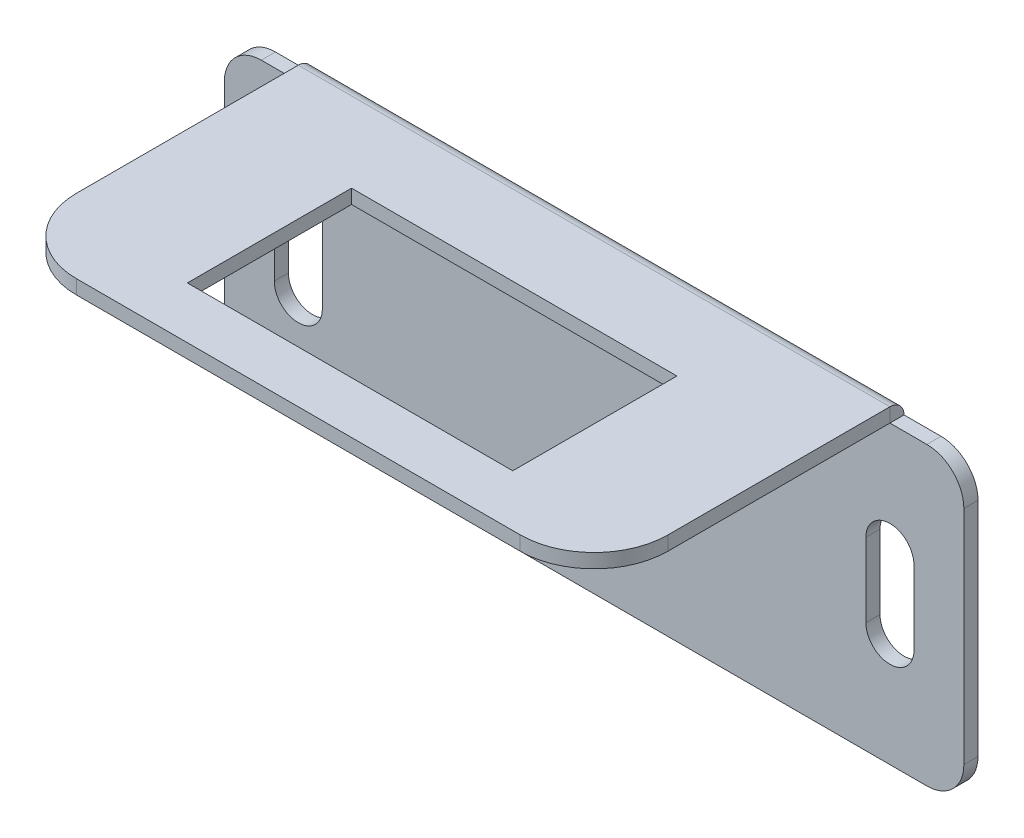
ISO-10303-21;
HEADER;
FILE_DESCRIPTION(('STEP AP214'),'2;1');
FILE_NAME('part.step','',(''),(''),'','','');
FILE_SCHEMA(('AUTOMOTIVE_DESIGN { 1 0 10303 214 1 1 1 1 }'));
ENDSEC;
DATA;
#1=APPLICATION_CONTEXT('core data for automotive mechanical design processes');
#2=APPLICATION_PROTOCOL_DEFINITION('international standard','automotive_design',2000,#1);
#3=PRODUCT_CONTEXT('',#1,'mechanical');
#4=PRODUCT('Part','Part','',(#3));
#5=PRODUCT_RELATED_PRODUCT_CATEGORY('part','',(#4));
#6=PRODUCT_DEFINITION_FORMATION('','',#4);
#7=PRODUCT_DEFINITION_CONTEXT('part definition',#1,'design');
#8=PRODUCT_DEFINITION('design','',#6,#7);
#9=PRODUCT_DEFINITION_SHAPE('','',#8);
#10=(LENGTH_UNIT() NAMED_UNIT(*) SI_UNIT(.MILLI.,.METRE.));
#11=(NAMED_UNIT(*) PLANE_ANGLE_UNIT() SI_UNIT($,.RADIAN.));
#12=(NAMED_UNIT(*) SI_UNIT($,.STERADIAN.) SOLID_ANGLE_UNIT());
#13=UNCERTAINTY_MEASURE_WITH_UNIT(LENGTH_MEASURE(1.E-05),#10,'distance_accuracy_value','');
#14=(GEOMETRIC_REPRESENTATION_CONTEXT(3) GLOBAL_UNCERTAINTY_ASSIGNED_CONTEXT((#13)) GLOBAL_UNIT_ASSIGNED_CONTEXT((#10,
#11,#12)) REPRESENTATION_CONTEXT('',''));
#15=CARTESIAN_POINT('',(0.,0.,0.));
#16=DIRECTION('',(0.,0.,1.));
#17=DIRECTION('',(1.,0.,0.));
#18=AXIS2_PLACEMENT_3D('',#15,#16,#17);
#19=CARTESIAN_POINT('',(0.,25.4,1.21412));
#20=DIRECTION('',(0.,-1.,0.));
#21=DIRECTION('',(0.,0.,-1.));
#22=AXIS2_PLACEMENT_3D('',#19,#20,#21);
#23=PLANE('',#22);
#24=DIRECTION('',(-1.,0.,0.));
#25=VECTOR('',#24,1.);
#26=CARTESIAN_POINT('',(0.,25.4,0.));
#27=LINE('',#26,#25);
#28=CARTESIAN_POINT('',(6.35,25.4,0.));
#29=VERTEX_POINT('',#28);
#30=CARTESIAN_POINT('',(3.175,25.4,0.));
#31=VERTEX_POINT('',#30);
#32=EDGE_CURVE('E390',#29,#31,#27,.T.);
#33=ORIENTED_EDGE('',*,*,#32,.T.);
#34=DIRECTION('',(0.,0.,-1.));
#35=VECTOR('',#34,1.);
#36=CARTESIAN_POINT('',(3.175,25.4,1.21412));
#37=LINE('',#36,#35);
#38=CARTESIAN_POINT('',(3.175,25.4,1.21412));
#39=VERTEX_POINT('',#38);
#40=EDGE_CURVE('E427',#31,#39,#37,.F.);
#41=ORIENTED_EDGE('',*,*,#40,.T.);
#42=DIRECTION('',(-1.,0.,0.));
#43=VECTOR('',#42,1.);
#44=CARTESIAN_POINT('',(0.,25.4,1.21412));
#45=LINE('',#44,#43);
#46=CARTESIAN_POINT('',(6.35,25.4,1.21411999999999));
#47=VERTEX_POINT('',#46);
#48=EDGE_CURVE('E400',#47,#39,#45,.T.);
#49=ORIENTED_EDGE('',*,*,#48,.F.);
#50=DIRECTION('',(0.,0.,1.));
#51=VECTOR('',#50,1.);
#52=CARTESIAN_POINT('',(6.35,25.4,0.));
#53=LINE('',#52,#51);
#54=EDGE_CURVE('E336',#29,#47,#53,.T.);
#55=ORIENTED_EDGE('',*,*,#54,.F.);
#56=EDGE_LOOP('',(#33,#41,#49,#55));
#57=FACE_BOUND('',#56,.T.);
#58=ADVANCED_FACE('F34',(#57),#23,.F.);
#59=CARTESIAN_POINT('',(0.,0.,1.21412));
#60=DIRECTION('',(1.,0.,0.));
#61=DIRECTION('',(0.,0.,-1.));
#62=AXIS2_PLACEMENT_3D('',#59,#60,#61);
#63=PLANE('',#62);
#64=DIRECTION('',(0.,-1.,0.));
#65=VECTOR('',#64,1.);
#66=CARTESIAN_POINT('',(0.,0.,0.));
#67=LINE('',#66,#65);
#68=CARTESIAN_POINT('',(0.,22.225,0.));
#69=VERTEX_POINT('',#68);
#70=CARTESIAN_POINT('',(0.,3.175,0.));
#71=VERTEX_POINT('',#70);
#72=EDGE_CURVE('E412',#69,#71,#67,.T.);
#73=ORIENTED_EDGE('',*,*,#72,.T.);
#74=DIRECTION('',(0.,0.,-1.));
#75=VECTOR('',#74,1.);
#76=CARTESIAN_POINT('',(0.,3.175,1.21412));
#77=LINE('',#76,#75);
#78=CARTESIAN_POINT('',(0.,3.175,1.21412));
#79=VERTEX_POINT('',#78);
#80=EDGE_CURVE('E417',#71,#79,#77,.F.);
#81=ORIENTED_EDGE('',*,*,#80,.T.);
#82=DIRECTION('',(0.,-1.,0.));
#83=VECTOR('',#82,1.);
#84=CARTESIAN_POINT('',(0.,0.,1.21412));
#85=LINE('',#84,#83);
#86=CARTESIAN_POINT('',(0.,22.225,1.21412));
#87=VERTEX_POINT('',#86);
#88=EDGE_CURVE('E389',#87,#79,#85,.T.);
#89=ORIENTED_EDGE('',*,*,#88,.F.);
#90=DIRECTION('',(0.,0.,-1.));
#91=VECTOR('',#90,1.);
#92=CARTESIAN_POINT('',(0.,22.225,1.21412));
#93=LINE('',#92,#91);
#94=EDGE_CURVE('E574',#87,#69,#93,.T.);
#95=ORIENTED_EDGE('',*,*,#94,.T.);
#96=EDGE_LOOP('',(#73,#81,#89,#95));
#97=FACE_BOUND('',#96,.T.);
#98=ADVANCED_FACE('F526',(#97),#63,.F.);
#99=CARTESIAN_POINT('',(0.,0.,1.21412));
#100=DIRECTION('',(0.,1.,0.));
#101=DIRECTION('',(0.,0.,1.));
#102=AXIS2_PLACEMENT_3D('',#99,#100,#101);
#103=PLANE('',#102);
#104=DIRECTION('',(1.,0.,0.));
#105=VECTOR('',#104,1.);
#106=CARTESIAN_POINT('',(0.,0.,1.21412));
#107=LINE('',#106,#105);
#108=CARTESIAN_POINT('',(3.175,0.,1.21412));
#109=VERTEX_POINT('',#108);
#110=CARTESIAN_POINT('',(60.325,0.,1.21412));
#111=VERTEX_POINT('',#110);
#112=EDGE_CURVE('E568',#109,#111,#107,.T.);
#113=ORIENTED_EDGE('',*,*,#112,.F.);
#114=DIRECTION('',(0.,0.,-1.));
#115=VECTOR('',#114,1.);
#116=CARTESIAN_POINT('',(3.175,0.,1.21412));
#117=LINE('',#116,#115);
#118=CARTESIAN_POINT('',(3.175,0.,0.));
#119=VERTEX_POINT('',#118);
#120=EDGE_CURVE('E382',#109,#119,#117,.T.);
#121=ORIENTED_EDGE('',*,*,#120,.T.);
#122=DIRECTION('',(1.,0.,0.));
#123=VECTOR('',#122,1.);
#124=CARTESIAN_POINT('',(0.,0.,0.));
#125=LINE('',#124,#123);
#126=CARTESIAN_POINT('',(60.325,0.,0.));
#127=VERTEX_POINT('',#126);
#128=EDGE_CURVE('E447',#119,#127,#125,.T.);
#129=ORIENTED_EDGE('',*,*,#128,.T.);
#130=DIRECTION('',(0.,0.,-1.));
#131=VECTOR('',#130,1.);
#132=CARTESIAN_POINT('',(60.325,0.,1.21412));
#133=LINE('',#132,#131);
#134=EDGE_CURVE('E380',#127,#111,#133,.F.);
#135=ORIENTED_EDGE('',*,*,#134,.T.);
#136=EDGE_LOOP('',(#113,#121,#129,#135));
#137=FACE_BOUND('',#136,.T.);
#138=ADVANCED_FACE('F531',(#137),#103,.F.);
#139=CARTESIAN_POINT('',(63.5,0.,1.21412));
#140=DIRECTION('',(-1.,0.,0.));
#141=DIRECTION('',(0.,0.,1.));
#142=AXIS2_PLACEMENT_3D('',#139,#140,#141);
#143=PLANE('',#142);
#144=DIRECTION('',(0.,1.,0.));
#145=VECTOR('',#144,1.);
#146=CARTESIAN_POINT('',(63.5,0.,1.21412));
#147=LINE('',#146,#145);
#148=CARTESIAN_POINT('',(63.5,3.175,1.21412));
#149=VERTEX_POINT('',#148);
#150=CARTESIAN_POINT('',(63.5,22.225,1.21412));
#151=VERTEX_POINT('',#150);
#152=EDGE_CURVE('E405',#149,#151,#147,.T.);
#153=ORIENTED_EDGE('',*,*,#152,.F.);
#154=DIRECTION('',(0.,0.,-1.));
#155=VECTOR('',#154,1.);
#156=CARTESIAN_POINT('',(63.5,3.175,1.21412));
#157=LINE('',#156,#155);
#158=CARTESIAN_POINT('',(63.5,3.175,0.));
#159=VERTEX_POINT('',#158);
#160=EDGE_CURVE('E42',#149,#159,#157,.T.);
#161=ORIENTED_EDGE('',*,*,#160,.T.);
#162=DIRECTION('',(0.,1.,0.));
#163=VECTOR('',#162,1.);
#164=CARTESIAN_POINT('',(63.5,0.,0.));
#165=LINE('',#164,#163);
#166=CARTESIAN_POINT('',(63.5,22.225,0.));
#167=VERTEX_POINT('',#166);
#168=EDGE_CURVE('E395',#159,#167,#165,.T.);
#169=ORIENTED_EDGE('',*,*,#168,.T.);
#170=DIRECTION('',(0.,0.,-1.));
#171=VECTOR('',#170,1.);
#172=CARTESIAN_POINT('',(63.5,22.225,1.21412));
#173=LINE('',#172,#171);
#174=EDGE_CURVE('E429',#167,#151,#173,.F.);
#175=ORIENTED_EDGE('',*,*,#174,.T.);
#176=EDGE_LOOP('',(#153,#161,#169,#175));
#177=FACE_BOUND('',#176,.T.);
#178=ADVANCED_FACE('F436',(#177),#143,.F.);
#179=CARTESIAN_POINT('',(60.325,25.4,1.21412));
#180=VERTEX_POINT('',#179);
#181=CARTESIAN_POINT('',(57.15,25.4,1.21412));
#182=VERTEX_POINT('',#181);
#183=EDGE_CURVE('E404',#180,#182,#45,.T.);
#184=ORIENTED_EDGE('',*,*,#183,.F.);
#185=DIRECTION('',(0.,0.,-1.));
#186=VECTOR('',#185,1.);
#187=CARTESIAN_POINT('',(60.325,25.4,1.21412));
#188=LINE('',#187,#186);
#189=CARTESIAN_POINT('',(60.325,25.4,0.));
#190=VERTEX_POINT('',#189);
#191=EDGE_CURVE('E11',#180,#190,#188,.T.);
#192=ORIENTED_EDGE('',*,*,#191,.T.);
#193=CARTESIAN_POINT('',(57.15,25.4,0.));
#194=VERTEX_POINT('',#193);
#195=EDGE_CURVE('E386',#190,#194,#27,.T.);
#196=ORIENTED_EDGE('',*,*,#195,.T.);
#197=DIRECTION('',(0.,0.,1.));
#198=VECTOR('',#197,1.);
#199=CARTESIAN_POINT('',(57.15,25.4,0.));
#200=LINE('',#199,#198);
#201=EDGE_CURVE('E406',#194,#182,#200,.T.);
#202=ORIENTED_EDGE('',*,*,#201,.T.);
#203=EDGE_LOOP('',(#184,#192,#196,#202));
#204=FACE_BOUND('',#203,.T.);
#205=ADVANCED_FACE('F475',(#204),#23,.F.);
#206=CARTESIAN_POINT('',(0.,25.4,1.21412));
#207=DIRECTION('',(0.,0.,-1.));
#208=DIRECTION('',(-1.,0.,0.));
#209=AXIS2_PLACEMENT_3D('',#206,#207,#208);
#210=PLANE('',#209);
#211=DIRECTION('',(0.,1.,0.));
#212=VECTOR('',#211,1.);
#213=CARTESIAN_POINT('',(4.28625000000001,9.525,1.21412));
#214=LINE('',#213,#212);
#215=CARTESIAN_POINT('',(4.28625000000001,9.525,1.21412));
#216=VERTEX_POINT('',#215);
#217=CARTESIAN_POINT('',(4.28625000000001,15.875,1.21412));
#218=VERTEX_POINT('',#217);
#219=EDGE_CURVE('E221',#216,#218,#214,.T.);
#220=ORIENTED_EDGE('',*,*,#219,.T.);
#221=CARTESIAN_POINT('',(6.35,15.875,1.21412));
#222=DIRECTION('',(0.,0.,-1.));
#223=DIRECTION('',(1.,0.,0.));
#224=AXIS2_PLACEMENT_3D('',#221,#222,#223);
#225=CIRCLE('',#224,2.06375);
#226=CARTESIAN_POINT('',(8.41375,15.875,1.21412));
#227=VERTEX_POINT('',#226);
#228=EDGE_CURVE('E215',#218,#227,#225,.T.);
#229=ORIENTED_EDGE('',*,*,#228,.T.);
#230=DIRECTION('',(0.,-1.,0.));
#231=VECTOR('',#230,1.);
#232=CARTESIAN_POINT('',(8.41375,9.525,1.21412));
#233=LINE('',#232,#231);
#234=CARTESIAN_POINT('',(8.41375,9.525,1.21412));
#235=VERTEX_POINT('',#234);
#236=EDGE_CURVE('E224',#227,#235,#233,.T.);
#237=ORIENTED_EDGE('',*,*,#236,.T.);
#238=CARTESIAN_POINT('',(6.35,9.525,1.21412));
#239=DIRECTION('',(0.,0.,-1.));
#240=DIRECTION('',(1.,0.,0.));
#241=AXIS2_PLACEMENT_3D('',#238,#239,#240);
#242=CIRCLE('',#241,2.06375);
#243=EDGE_CURVE('E49',#235,#216,#242,.T.);
#244=ORIENTED_EDGE('',*,*,#243,.T.);
#245=EDGE_LOOP('',(#220,#229,#237,#244));
#246=FACE_BOUND('',#245,.T.);
#247=DIRECTION('',(0.,-1.,0.));
#248=VECTOR('',#247,1.);
#249=CARTESIAN_POINT('',(59.21375,9.525,1.21412));
#250=LINE('',#249,#248);
#251=CARTESIAN_POINT('',(59.21375,15.875,1.21412));
#252=VERTEX_POINT('',#251);
#253=CARTESIAN_POINT('',(59.21375,9.525,1.21412));
#254=VERTEX_POINT('',#253);
#255=EDGE_CURVE('E260',#252,#254,#250,.T.);
#256=ORIENTED_EDGE('',*,*,#255,.T.);
#257=CARTESIAN_POINT('',(57.15,9.525,1.21412));
#258=DIRECTION('',(0.,0.,-1.));
#259=DIRECTION('',(-1.,0.,0.));
#260=AXIS2_PLACEMENT_3D('',#257,#258,#259);
#261=CIRCLE('',#260,2.06375);
#262=CARTESIAN_POINT('',(55.08625,9.525,1.21412));
#263=VERTEX_POINT('',#262);
#264=EDGE_CURVE('E250',#254,#263,#261,.T.);
#265=ORIENTED_EDGE('',*,*,#264,.T.);
#266=DIRECTION('',(0.,1.,0.));
#267=VECTOR('',#266,1.);
#268=CARTESIAN_POINT('',(55.08625,9.525,1.21412));
#269=LINE('',#268,#267);
#270=CARTESIAN_POINT('',(55.08625,15.875,1.21412));
#271=VERTEX_POINT('',#270);
#272=EDGE_CURVE('E253',#263,#271,#269,.T.);
#273=ORIENTED_EDGE('',*,*,#272,.T.);
#274=CARTESIAN_POINT('',(57.15,15.875,1.21412));
#275=DIRECTION('',(0.,0.,-1.));
#276=DIRECTION('',(-1.,0.,0.));
#277=AXIS2_PLACEMENT_3D('',#274,#275,#276);
#278=CIRCLE('',#277,2.06375);
#279=EDGE_CURVE('E257',#271,#252,#278,.T.);
#280=ORIENTED_EDGE('',*,*,#279,.T.);
#281=EDGE_LOOP('',(#256,#265,#273,#280));
#282=FACE_BOUND('',#281,.T.);
#283=ORIENTED_EDGE('',*,*,#88,.T.);
#284=CARTESIAN_POINT('',(3.175,3.175,1.21412));
#285=DIRECTION('',(0.,0.,-1.));
#286=DIRECTION('',(-1.,0.,0.));
#287=AXIS2_PLACEMENT_3D('',#284,#285,#286);
#288=CIRCLE('',#287,3.175);
#289=EDGE_CURVE('E425',#79,#109,#288,.F.);
#290=ORIENTED_EDGE('',*,*,#289,.T.);
#291=ORIENTED_EDGE('',*,*,#112,.T.);
#292=CARTESIAN_POINT('',(60.325,3.175,1.21412));
#293=DIRECTION('',(0.,0.,-1.));
#294=DIRECTION('',(-1.,0.,0.));
#295=AXIS2_PLACEMENT_3D('',#292,#293,#294);
#296=CIRCLE('',#295,3.175);
#297=EDGE_CURVE('E421',#111,#149,#296,.F.);
#298=ORIENTED_EDGE('',*,*,#297,.T.);
#299=ORIENTED_EDGE('',*,*,#152,.T.);
#300=CARTESIAN_POINT('',(60.325,22.225,1.21412));
#301=DIRECTION('',(0.,0.,-1.));
#302=DIRECTION('',(-1.,0.,0.));
#303=AXIS2_PLACEMENT_3D('',#300,#301,#302);
#304=CIRCLE('',#303,3.175);
#305=EDGE_CURVE('E419',#151,#180,#304,.F.);
#306=ORIENTED_EDGE('',*,*,#305,.T.);
#307=ORIENTED_EDGE('',*,*,#183,.T.);
#308=DIRECTION('',(-1.,0.,0.));
#309=VECTOR('',#308,1.);
#310=CARTESIAN_POINT('',(6.35,25.4,1.21411999999999));
#311=LINE('',#310,#309);
#312=EDGE_CURVE('E318',#182,#47,#311,.T.);
#313=ORIENTED_EDGE('',*,*,#312,.T.);
#314=ORIENTED_EDGE('',*,*,#48,.T.);
#315=CARTESIAN_POINT('',(3.175,22.225,1.21412));
#316=DIRECTION('',(0.,0.,-1.));
#317=DIRECTION('',(-1.,0.,0.));
#318=AXIS2_PLACEMENT_3D('',#315,#316,#317);
#319=CIRCLE('',#318,3.175);
#320=EDGE_CURVE('E423',#39,#87,#319,.F.);
#321=ORIENTED_EDGE('',*,*,#320,.T.);
#322=EDGE_LOOP('',(#283,#290,#291,#298,#299,#306,#307,#313,#314,#321));
#323=FACE_BOUND('',#322,.T.);
#324=ADVANCED_FACE('F228',(#246,#282,#323),#210,.F.);
#325=CARTESIAN_POINT('',(0.,25.4,0.));
#326=DIRECTION('',(0.,0.,-1.));
#327=DIRECTION('',(-1.,0.,0.));
#328=AXIS2_PLACEMENT_3D('',#325,#326,#327);
#329=PLANE('',#328);
#330=CARTESIAN_POINT('',(6.35,15.875,0.));
#331=DIRECTION('',(0.,0.,-1.));
#332=DIRECTION('',(1.,0.,0.));
#333=AXIS2_PLACEMENT_3D('',#330,#331,#332);
#334=CIRCLE('',#333,2.06375);
#335=CARTESIAN_POINT('',(4.28625000000001,15.875,0.));
#336=VERTEX_POINT('',#335);
#337=CARTESIAN_POINT('',(8.41375,15.875,0.));
#338=VERTEX_POINT('',#337);
#339=EDGE_CURVE('E57',#336,#338,#334,.T.);
#340=ORIENTED_EDGE('',*,*,#339,.F.);
#341=DIRECTION('',(0.,1.,0.));
#342=VECTOR('',#341,1.);
#343=CARTESIAN_POINT('',(4.28625000000001,9.525,0.));
#344=LINE('',#343,#342);
#345=CARTESIAN_POINT('',(4.28625000000001,9.525,0.));
#346=VERTEX_POINT('',#345);
#347=EDGE_CURVE('E231',#346,#336,#344,.T.);
#348=ORIENTED_EDGE('',*,*,#347,.F.);
#349=CARTESIAN_POINT('',(6.35,9.525,0.));
#350=DIRECTION('',(0.,0.,-1.));
#351=DIRECTION('',(1.,0.,0.));
#352=AXIS2_PLACEMENT_3D('',#349,#350,#351);
#353=CIRCLE('',#352,2.06375);
#354=CARTESIAN_POINT('',(8.41375,9.525,0.));
#355=VERTEX_POINT('',#354);
#356=EDGE_CURVE('E234',#355,#346,#353,.T.);
#357=ORIENTED_EDGE('',*,*,#356,.F.);
#358=DIRECTION('',(0.,-1.,0.));
#359=VECTOR('',#358,1.);
#360=CARTESIAN_POINT('',(8.41375,9.525,0.));
#361=LINE('',#360,#359);
#362=EDGE_CURVE('E240',#338,#355,#361,.T.);
#363=ORIENTED_EDGE('',*,*,#362,.F.);
#364=EDGE_LOOP('',(#340,#348,#357,#363));
#365=FACE_BOUND('',#364,.T.);
#366=CARTESIAN_POINT('',(57.15,9.525,0.));
#367=DIRECTION('',(0.,0.,-1.));
#368=DIRECTION('',(-1.,0.,0.));
#369=AXIS2_PLACEMENT_3D('',#366,#367,#368);
#370=CIRCLE('',#369,2.06375);
#371=CARTESIAN_POINT('',(59.21375,9.525,0.));
#372=VERTEX_POINT('',#371);
#373=CARTESIAN_POINT('',(55.08625,9.525,0.));
#374=VERTEX_POINT('',#373);
#375=EDGE_CURVE('E246',#372,#374,#370,.T.);
#376=ORIENTED_EDGE('',*,*,#375,.F.);
#377=DIRECTION('',(0.,-1.,0.));
#378=VECTOR('',#377,1.);
#379=CARTESIAN_POINT('',(59.21375,9.525,0.));
#380=LINE('',#379,#378);
#381=CARTESIAN_POINT('',(59.21375,15.875,0.));
#382=VERTEX_POINT('',#381);
#383=EDGE_CURVE('E254',#382,#372,#380,.T.);
#384=ORIENTED_EDGE('',*,*,#383,.F.);
#385=CARTESIAN_POINT('',(57.15,15.875,0.));
#386=DIRECTION('',(0.,0.,-1.));
#387=DIRECTION('',(-1.,0.,0.));
#388=AXIS2_PLACEMENT_3D('',#385,#386,#387);
#389=CIRCLE('',#388,2.06375);
#390=CARTESIAN_POINT('',(55.08625,15.875,0.));
#391=VERTEX_POINT('',#390);
#392=EDGE_CURVE('E268',#391,#382,#389,.T.);
#393=ORIENTED_EDGE('',*,*,#392,.F.);
#394=DIRECTION('',(0.,1.,0.));
#395=VECTOR('',#394,1.);
#396=CARTESIAN_POINT('',(55.08625,9.525,0.));
#397=LINE('',#396,#395);
#398=EDGE_CURVE('E265',#374,#391,#397,.T.);
#399=ORIENTED_EDGE('',*,*,#398,.F.);
#400=EDGE_LOOP('',(#376,#384,#393,#399));
#401=FACE_BOUND('',#400,.T.);
#402=ORIENTED_EDGE('',*,*,#128,.F.);
#403=CARTESIAN_POINT('',(3.175,3.175,0.));
#404=DIRECTION('',(0.,0.,-1.));
#405=DIRECTION('',(-1.,0.,0.));
#406=AXIS2_PLACEMENT_3D('',#403,#404,#405);
#407=CIRCLE('',#406,3.175);
#408=EDGE_CURVE('E573',#119,#71,#407,.T.);
#409=ORIENTED_EDGE('',*,*,#408,.T.);
#410=ORIENTED_EDGE('',*,*,#72,.F.);
#411=CARTESIAN_POINT('',(3.175,22.225,0.));
#412=DIRECTION('',(0.,0.,-1.));
#413=DIRECTION('',(-1.,0.,0.));
#414=AXIS2_PLACEMENT_3D('',#411,#412,#413);
#415=CIRCLE('',#414,3.175);
#416=EDGE_CURVE('E575',#69,#31,#415,.T.);
#417=ORIENTED_EDGE('',*,*,#416,.T.);
#418=ORIENTED_EDGE('',*,*,#32,.F.);
#419=DIRECTION('',(-1.,0.,0.));
#420=VECTOR('',#419,1.);
#421=CARTESIAN_POINT('',(6.35,25.4,0.));
#422=LINE('',#421,#420);
#423=EDGE_CURVE('E340',#194,#29,#422,.T.);
#424=ORIENTED_EDGE('',*,*,#423,.F.);
#425=ORIENTED_EDGE('',*,*,#195,.F.);
#426=CARTESIAN_POINT('',(60.325,22.225,0.));
#427=DIRECTION('',(0.,0.,-1.));
#428=DIRECTION('',(-1.,0.,0.));
#429=AXIS2_PLACEMENT_3D('',#426,#427,#428);
#430=CIRCLE('',#429,3.175);
#431=EDGE_CURVE('E385',#190,#167,#430,.T.);
#432=ORIENTED_EDGE('',*,*,#431,.T.);
#433=ORIENTED_EDGE('',*,*,#168,.F.);
#434=CARTESIAN_POINT('',(60.325,3.175,0.));
#435=DIRECTION('',(0.,0.,-1.));
#436=DIRECTION('',(-1.,0.,0.));
#437=AXIS2_PLACEMENT_3D('',#434,#435,#436);
#438=CIRCLE('',#437,3.175);
#439=EDGE_CURVE('E444',#159,#127,#438,.T.);
#440=ORIENTED_EDGE('',*,*,#439,.T.);
#441=EDGE_LOOP('',(#402,#409,#410,#417,#418,#424,#425,#432,#433,#440));
#442=FACE_BOUND('',#441,.T.);
#443=ADVANCED_FACE('F443',(#365,#401,#442),#329,.T.);
#444=CARTESIAN_POINT('',(6.35,25.4,0.));
#445=DIRECTION('',(-1.,0.,0.));
#446=DIRECTION('',(0.,0.,1.));
#447=AXIS2_PLACEMENT_3D('',#444,#445,#446);
#448=PLANE('',#447);
#449=CARTESIAN_POINT('',(6.35,25.4,1.21411999999999));
#450=DIRECTION('',(1.,0.,0.));
#451=DIRECTION('',(0.,0.,-1.));
#452=AXIS2_PLACEMENT_3D('',#449,#450,#451);
#453=CIRCLE('',#452,1.21412);
#454=CARTESIAN_POINT('',(6.35,26.61412,1.21411999999999));
#455=VERTEX_POINT('',#454);
#456=EDGE_CURVE('E451',#29,#455,#453,.T.);
#457=ORIENTED_EDGE('',*,*,#456,.F.);
#458=ORIENTED_EDGE('',*,*,#54,.T.);
#459=DIRECTION('',(0.,-1.,0.));
#460=VECTOR('',#459,1.);
#461=CARTESIAN_POINT('',(6.35,26.61412,1.21411999999999));
#462=LINE('',#461,#460);
#463=EDGE_CURVE('E326',#455,#47,#462,.T.);
#464=ORIENTED_EDGE('',*,*,#463,.F.);
#465=EDGE_LOOP('',(#457,#458,#464));
#466=FACE_BOUND('',#465,.T.);
#467=ADVANCED_FACE('F491',(#466),#448,.T.);
#468=CARTESIAN_POINT('',(57.15,25.4,1.21411999999999));
#469=DIRECTION('',(1.,0.,0.));
#470=DIRECTION('',(0.,0.,-1.));
#471=AXIS2_PLACEMENT_3D('',#468,#469,#470);
#472=CYLINDRICAL_SURFACE('',#471,1.21412);
#473=CARTESIAN_POINT('',(57.15,25.4,1.21411999999999));
#474=DIRECTION('',(1.,0.,0.));
#475=DIRECTION('',(0.,0.,-1.));
#476=AXIS2_PLACEMENT_3D('',#473,#474,#475);
#477=CIRCLE('',#476,1.21412);
#478=CARTESIAN_POINT('',(57.15,26.61412,1.21411999999998));
#479=VERTEX_POINT('',#478);
#480=EDGE_CURVE('E456',#194,#479,#477,.T.);
#481=ORIENTED_EDGE('',*,*,#480,.F.);
#482=ORIENTED_EDGE('',*,*,#423,.T.);
#483=ORIENTED_EDGE('',*,*,#456,.T.);
#484=DIRECTION('',(-1.,0.,0.));
#485=VECTOR('',#484,1.);
#486=CARTESIAN_POINT('',(6.35,26.61412,1.21411999999999));
#487=LINE('',#486,#485);
#488=EDGE_CURVE('E323',#479,#455,#487,.T.);
#489=ORIENTED_EDGE('',*,*,#488,.F.);
#490=EDGE_LOOP('',(#481,#482,#483,#489));
#491=FACE_BOUND('',#490,.T.);
#492=ADVANCED_FACE('F516',(#491),#472,.T.);
#493=CARTESIAN_POINT('',(57.15,25.4,0.));
#494=DIRECTION('',(-1.,0.,0.));
#495=DIRECTION('',(0.,0.,1.));
#496=AXIS2_PLACEMENT_3D('',#493,#494,#495);
#497=PLANE('',#496);
#498=ORIENTED_EDGE('',*,*,#201,.F.);
#499=ORIENTED_EDGE('',*,*,#480,.T.);
#500=DIRECTION('',(0.,-1.,0.));
#501=VECTOR('',#500,1.);
#502=CARTESIAN_POINT('',(57.15,26.61412,1.21411999999998));
#503=LINE('',#502,#501);
#504=EDGE_CURVE('E341',#479,#182,#503,.T.);
#505=ORIENTED_EDGE('',*,*,#504,.T.);
#506=EDGE_LOOP('',(#498,#499,#505));
#507=FACE_BOUND('',#506,.T.);
#508=ADVANCED_FACE('F515',(#507),#497,.F.);
#509=CARTESIAN_POINT('',(6.35,26.6141200000001,26.61412));
#510=DIRECTION('',(1.,0.,0.));
#511=DIRECTION('',(0.,0.,-1.));
#512=AXIS2_PLACEMENT_3D('',#509,#510,#511);
#513=PLANE('',#512);
#514=DIRECTION('',(0.,0.,1.));
#515=VECTOR('',#514,1.);
#516=CARTESIAN_POINT('',(6.35,25.4000000000001,26.61412));
#517=LINE('',#516,#515);
#518=CARTESIAN_POINT('',(6.35,25.4000000000001,20.26412));
#519=VERTEX_POINT('',#518);
#520=EDGE_CURVE('E307',#47,#519,#517,.T.);
#521=ORIENTED_EDGE('',*,*,#520,.T.);
#522=DIRECTION('',(0.,-1.,0.));
#523=VECTOR('',#522,1.);
#524=CARTESIAN_POINT('',(6.35,26.6141200000001,20.26412));
#525=LINE('',#524,#523);
#526=CARTESIAN_POINT('',(6.35,26.6141200000001,20.26412));
#527=VERTEX_POINT('',#526);
#528=EDGE_CURVE('E371',#519,#527,#525,.F.);
#529=ORIENTED_EDGE('',*,*,#528,.T.);
#530=DIRECTION('',(0.,0.,1.));
#531=VECTOR('',#530,1.);
#532=CARTESIAN_POINT('',(6.35,26.6141200000001,26.61412));
#533=LINE('',#532,#531);
#534=EDGE_CURVE('E314',#455,#527,#533,.T.);
#535=ORIENTED_EDGE('',*,*,#534,.F.);
#536=ORIENTED_EDGE('',*,*,#463,.T.);
#537=EDGE_LOOP('',(#521,#529,#535,#536));
#538=FACE_BOUND('',#537,.T.);
#539=ADVANCED_FACE('F494',(#538),#513,.F.);
#540=CARTESIAN_POINT('',(57.15,26.6141200000001,26.61412));
#541=DIRECTION('',(0.,0.,-1.));
#542=DIRECTION('',(0.,1.,0.));
#543=AXIS2_PLACEMENT_3D('',#540,#541,#542);
#544=PLANE('',#543);
#545=DIRECTION('',(1.,0.,0.));
#546=VECTOR('',#545,1.);
#547=CARTESIAN_POINT('',(57.15,26.6141200000001,26.61412));
#548=LINE('',#547,#546);
#549=CARTESIAN_POINT('',(12.7,26.6141200000001,26.61412));
#550=VERTEX_POINT('',#549);
#551=CARTESIAN_POINT('',(50.8,26.6141200000001,26.61412));
#552=VERTEX_POINT('',#551);
#553=EDGE_CURVE('E317',#550,#552,#548,.T.);
#554=ORIENTED_EDGE('',*,*,#553,.F.);
#555=DIRECTION('',(0.,-1.,0.));
#556=VECTOR('',#555,1.);
#557=CARTESIAN_POINT('',(12.7,26.6141200000001,26.61412));
#558=LINE('',#557,#556);
#559=CARTESIAN_POINT('',(12.7,25.4000000000001,26.61412));
#560=VERTEX_POINT('',#559);
#561=EDGE_CURVE('E366',#550,#560,#558,.T.);
#562=ORIENTED_EDGE('',*,*,#561,.T.);
#563=DIRECTION('',(1.,0.,0.));
#564=VECTOR('',#563,1.);
#565=CARTESIAN_POINT('',(57.15,25.4000000000001,26.61412));
#566=LINE('',#565,#564);
#567=CARTESIAN_POINT('',(50.8,25.4000000000001,26.61412));
#568=VERTEX_POINT('',#567);
#569=EDGE_CURVE('E327',#560,#568,#566,.T.);
#570=ORIENTED_EDGE('',*,*,#569,.T.);
#571=DIRECTION('',(0.,-1.,0.));
#572=VECTOR('',#571,1.);
#573=CARTESIAN_POINT('',(50.8,26.6141200000001,26.61412));
#574=LINE('',#573,#572);
#575=EDGE_CURVE('E361',#568,#552,#574,.F.);
#576=ORIENTED_EDGE('',*,*,#575,.T.);
#577=EDGE_LOOP('',(#554,#562,#570,#576));
#578=FACE_BOUND('',#577,.T.);
#579=ADVANCED_FACE('F506',(#578),#544,.F.);
#580=CARTESIAN_POINT('',(57.15,26.6141200000001,26.61412));
#581=DIRECTION('',(-1.,0.,0.));
#582=DIRECTION('',(0.,0.,1.));
#583=AXIS2_PLACEMENT_3D('',#580,#581,#582);
#584=PLANE('',#583);
#585=DIRECTION('',(0.,0.,-1.));
#586=VECTOR('',#585,1.);
#587=CARTESIAN_POINT('',(57.15,26.6141200000001,26.61412));
#588=LINE('',#587,#586);
#589=CARTESIAN_POINT('',(57.15,26.6141200000001,20.26412));
#590=VERTEX_POINT('',#589);
#591=EDGE_CURVE('E321',#590,#479,#588,.T.);
#592=ORIENTED_EDGE('',*,*,#591,.F.);
#593=DIRECTION('',(0.,-1.,0.));
#594=VECTOR('',#593,1.);
#595=CARTESIAN_POINT('',(57.15,26.6141200000001,20.26412));
#596=LINE('',#595,#594);
#597=CARTESIAN_POINT('',(57.15,25.4000000000001,20.26412));
#598=VERTEX_POINT('',#597);
#599=EDGE_CURVE('E377',#590,#598,#596,.T.);
#600=ORIENTED_EDGE('',*,*,#599,.T.);
#601=DIRECTION('',(0.,0.,-1.));
#602=VECTOR('',#601,1.);
#603=CARTESIAN_POINT('',(57.15,25.4000000000001,26.61412));
#604=LINE('',#603,#602);
#605=EDGE_CURVE('E330',#598,#182,#604,.T.);
#606=ORIENTED_EDGE('',*,*,#605,.T.);
#607=ORIENTED_EDGE('',*,*,#504,.F.);
#608=EDGE_LOOP('',(#592,#600,#606,#607));
#609=FACE_BOUND('',#608,.T.);
#610=ADVANCED_FACE('F513',(#609),#584,.F.);
#611=CARTESIAN_POINT('',(6.35000000000001,26.6141200000001,26.61412));
#612=DIRECTION('',(0.,1.,0.));
#613=DIRECTION('',(0.,0.,1.));
#614=AXIS2_PLACEMENT_3D('',#611,#612,#613);
#615=PLANE('',#614);
#616=DIRECTION('',(0.,0.,1.));
#617=VECTOR('',#616,1.);
#618=CARTESIAN_POINT('',(17.78,26.6141200000001,22.16912));
#619=LINE('',#618,#617);
#620=CARTESIAN_POINT('',(17.78,26.61412,8.07211999999999));
#621=VERTEX_POINT('',#620);
#622=CARTESIAN_POINT('',(17.78,26.6141200000001,22.16912));
#623=VERTEX_POINT('',#622);
#624=EDGE_CURVE('E275',#621,#623,#619,.T.);
#625=ORIENTED_EDGE('',*,*,#624,.F.);
#626=DIRECTION('',(-1.,0.,0.));
#627=VECTOR('',#626,1.);
#628=CARTESIAN_POINT('',(17.78,26.61412,8.07211999999999));
#629=LINE('',#628,#627);
#630=CARTESIAN_POINT('',(45.72,26.61412,8.07211999999999));
#631=VERTEX_POINT('',#630);
#632=EDGE_CURVE('E286',#631,#621,#629,.T.);
#633=ORIENTED_EDGE('',*,*,#632,.F.);
#634=DIRECTION('',(0.,0.,-1.));
#635=VECTOR('',#634,1.);
#636=CARTESIAN_POINT('',(45.72,26.6141200000001,22.16912));
#637=LINE('',#636,#635);
#638=CARTESIAN_POINT('',(45.72,26.6141200000001,22.16912));
#639=VERTEX_POINT('',#638);
#640=EDGE_CURVE('E300',#639,#631,#637,.T.);
#641=ORIENTED_EDGE('',*,*,#640,.F.);
#642=DIRECTION('',(1.,0.,0.));
#643=VECTOR('',#642,1.);
#644=CARTESIAN_POINT('',(17.78,26.6141200000001,22.16912));
#645=LINE('',#644,#643);
#646=EDGE_CURVE('E297',#623,#639,#645,.T.);
#647=ORIENTED_EDGE('',*,*,#646,.F.);
#648=EDGE_LOOP('',(#625,#633,#641,#647));
#649=FACE_BOUND('',#648,.T.);
#650=ORIENTED_EDGE('',*,*,#534,.T.);
#651=CARTESIAN_POINT('',(12.7,26.6141200000001,20.26412));
#652=DIRECTION('',(0.,1.,0.));
#653=DIRECTION('',(0.,0.,1.));
#654=AXIS2_PLACEMENT_3D('',#651,#652,#653);
#655=CIRCLE('',#654,6.35);
#656=EDGE_CURVE('E375',#527,#550,#655,.T.);
#657=ORIENTED_EDGE('',*,*,#656,.T.);
#658=ORIENTED_EDGE('',*,*,#553,.T.);
#659=CARTESIAN_POINT('',(50.8,26.6141200000001,20.26412));
#660=DIRECTION('',(0.,1.,0.));
#661=DIRECTION('',(0.,0.,1.));
#662=AXIS2_PLACEMENT_3D('',#659,#660,#661);
#663=CIRCLE('',#662,6.35);
#664=EDGE_CURVE('E373',#552,#590,#663,.T.);
#665=ORIENTED_EDGE('',*,*,#664,.T.);
#666=ORIENTED_EDGE('',*,*,#591,.T.);
#667=ORIENTED_EDGE('',*,*,#488,.T.);
#668=EDGE_LOOP('',(#650,#657,#658,#665,#666,#667));
#669=FACE_BOUND('',#668,.T.);
#670=ADVANCED_FACE('F498',(#649,#669),#615,.T.);
#671=CARTESIAN_POINT('',(6.35000000000001,25.4000000000001,26.61412));
#672=DIRECTION('',(0.,1.,0.));
#673=DIRECTION('',(0.,0.,1.));
#674=AXIS2_PLACEMENT_3D('',#671,#672,#673);
#675=PLANE('',#674);
#676=DIRECTION('',(-1.,0.,0.));
#677=VECTOR('',#676,1.);
#678=CARTESIAN_POINT('',(17.78,25.4,8.07212));
#679=LINE('',#678,#677);
#680=CARTESIAN_POINT('',(45.72,25.4,8.07211999999999));
#681=VERTEX_POINT('',#680);
#682=CARTESIAN_POINT('',(17.78,25.4,8.07212));
#683=VERTEX_POINT('',#682);
#684=EDGE_CURVE('E292',#681,#683,#679,.T.);
#685=ORIENTED_EDGE('',*,*,#684,.T.);
#686=DIRECTION('',(0.,0.,1.));
#687=VECTOR('',#686,1.);
#688=CARTESIAN_POINT('',(17.78,25.4000000000001,22.16912));
#689=LINE('',#688,#687);
#690=CARTESIAN_POINT('',(17.78,25.4000000000001,22.16912));
#691=VERTEX_POINT('',#690);
#692=EDGE_CURVE('E282',#683,#691,#689,.T.);
#693=ORIENTED_EDGE('',*,*,#692,.T.);
#694=DIRECTION('',(1.,0.,0.));
#695=VECTOR('',#694,1.);
#696=CARTESIAN_POINT('',(17.78,25.4000000000001,22.16912));
#697=LINE('',#696,#695);
#698=CARTESIAN_POINT('',(45.72,25.4000000000001,22.16912));
#699=VERTEX_POINT('',#698);
#700=EDGE_CURVE('E285',#691,#699,#697,.T.);
#701=ORIENTED_EDGE('',*,*,#700,.T.);
#702=DIRECTION('',(0.,0.,-1.));
#703=VECTOR('',#702,1.);
#704=CARTESIAN_POINT('',(45.72,25.4000000000001,22.16912));
#705=LINE('',#704,#703);
#706=EDGE_CURVE('E289',#699,#681,#705,.T.);
#707=ORIENTED_EDGE('',*,*,#706,.T.);
#708=EDGE_LOOP('',(#685,#693,#701,#707));
#709=FACE_BOUND('',#708,.T.);
#710=ORIENTED_EDGE('',*,*,#569,.F.);
#711=CARTESIAN_POINT('',(12.7,25.4000000000001,20.26412));
#712=DIRECTION('',(0.,1.,0.));
#713=DIRECTION('',(0.,0.,1.));
#714=AXIS2_PLACEMENT_3D('',#711,#712,#713);
#715=CIRCLE('',#714,6.35);
#716=EDGE_CURVE('E369',#560,#519,#715,.F.);
#717=ORIENTED_EDGE('',*,*,#716,.T.);
#718=ORIENTED_EDGE('',*,*,#520,.F.);
#719=ORIENTED_EDGE('',*,*,#312,.F.);
#720=ORIENTED_EDGE('',*,*,#605,.F.);
#721=CARTESIAN_POINT('',(50.8,25.4000000000001,20.26412));
#722=DIRECTION('',(0.,1.,0.));
#723=DIRECTION('',(0.,0.,1.));
#724=AXIS2_PLACEMENT_3D('',#721,#722,#723);
#725=CIRCLE('',#724,6.35);
#726=EDGE_CURVE('E367',#598,#568,#725,.F.);
#727=ORIENTED_EDGE('',*,*,#726,.T.);
#728=EDGE_LOOP('',(#710,#717,#718,#719,#720,#727));
#729=FACE_BOUND('',#728,.T.);
#730=ADVANCED_FACE('F482',(#709,#729),#675,.F.);
#731=CARTESIAN_POINT('',(17.78,25.4000000000001,22.16912));
#732=DIRECTION('',(-1.,0.,0.));
#733=DIRECTION('',(0.,-1.,0.));
#734=AXIS2_PLACEMENT_3D('',#731,#732,#733);
#735=PLANE('',#734);
#736=ORIENTED_EDGE('',*,*,#624,.T.);
#737=DIRECTION('',(0.,1.,0.));
#738=VECTOR('',#737,1.);
#739=CARTESIAN_POINT('',(17.78,25.4000000000001,22.16912));
#740=LINE('',#739,#738);
#741=EDGE_CURVE('E295',#691,#623,#740,.T.);
#742=ORIENTED_EDGE('',*,*,#741,.F.);
#743=ORIENTED_EDGE('',*,*,#692,.F.);
#744=DIRECTION('',(0.,1.,0.));
#745=VECTOR('',#744,1.);
#746=CARTESIAN_POINT('',(17.78,25.4,8.07212));
#747=LINE('',#746,#745);
#748=EDGE_CURVE('E305',#683,#621,#747,.T.);
#749=ORIENTED_EDGE('',*,*,#748,.T.);
#750=EDGE_LOOP('',(#736,#742,#743,#749));
#751=FACE_BOUND('',#750,.T.);
#752=ADVANCED_FACE('F598',(#751),#735,.F.);
#753=CARTESIAN_POINT('',(17.78,25.4,8.07212));
#754=DIRECTION('',(0.,0.,-1.));
#755=DIRECTION('',(0.,1.,0.));
#756=AXIS2_PLACEMENT_3D('',#753,#754,#755);
#757=PLANE('',#756);
#758=ORIENTED_EDGE('',*,*,#632,.T.);
#759=ORIENTED_EDGE('',*,*,#748,.F.);
#760=ORIENTED_EDGE('',*,*,#684,.F.);
#761=DIRECTION('',(0.,1.,0.));
#762=VECTOR('',#761,1.);
#763=CARTESIAN_POINT('',(45.72,25.4,8.07211999999999));
#764=LINE('',#763,#762);
#765=EDGE_CURVE('E308',#681,#631,#764,.T.);
#766=ORIENTED_EDGE('',*,*,#765,.T.);
#767=EDGE_LOOP('',(#758,#759,#760,#766));
#768=FACE_BOUND('',#767,.T.);
#769=ADVANCED_FACE('F594',(#768),#757,.F.);
#770=CARTESIAN_POINT('',(45.72,25.4000000000001,22.16912));
#771=DIRECTION('',(1.,0.,0.));
#772=DIRECTION('',(0.,1.,0.));
#773=AXIS2_PLACEMENT_3D('',#770,#771,#772);
#774=PLANE('',#773);
#775=ORIENTED_EDGE('',*,*,#640,.T.);
#776=ORIENTED_EDGE('',*,*,#765,.F.);
#777=ORIENTED_EDGE('',*,*,#706,.F.);
#778=DIRECTION('',(0.,1.,0.));
#779=VECTOR('',#778,1.);
#780=CARTESIAN_POINT('',(45.72,25.4000000000001,22.16912));
#781=LINE('',#780,#779);
#782=EDGE_CURVE('E310',#699,#639,#781,.T.);
#783=ORIENTED_EDGE('',*,*,#782,.T.);
#784=EDGE_LOOP('',(#775,#776,#777,#783));
#785=FACE_BOUND('',#784,.T.);
#786=ADVANCED_FACE('F597',(#785),#774,.F.);
#787=CARTESIAN_POINT('',(17.78,25.4000000000001,22.16912));
#788=DIRECTION('',(0.,0.,1.));
#789=DIRECTION('',(0.,-1.,0.));
#790=AXIS2_PLACEMENT_3D('',#787,#788,#789);
#791=PLANE('',#790);
#792=ORIENTED_EDGE('',*,*,#646,.T.);
#793=ORIENTED_EDGE('',*,*,#782,.F.);
#794=ORIENTED_EDGE('',*,*,#700,.F.);
#795=ORIENTED_EDGE('',*,*,#741,.T.);
#796=EDGE_LOOP('',(#792,#793,#794,#795));
#797=FACE_BOUND('',#796,.T.);
#798=ADVANCED_FACE('F548',(#797),#791,.F.);
#799=CARTESIAN_POINT('',(12.7,26.6141200000001,20.26412));
#800=DIRECTION('',(0.,-1.,0.));
#801=DIRECTION('',(0.,0.,-1.));
#802=AXIS2_PLACEMENT_3D('',#799,#800,#801);
#803=CYLINDRICAL_SURFACE('',#802,6.35);
#804=ORIENTED_EDGE('',*,*,#656,.F.);
#805=ORIENTED_EDGE('',*,*,#528,.F.);
#806=ORIENTED_EDGE('',*,*,#716,.F.);
#807=ORIENTED_EDGE('',*,*,#561,.F.);
#808=EDGE_LOOP('',(#804,#805,#806,#807));
#809=FACE_BOUND('',#808,.T.);
#810=ADVANCED_FACE('F502',(#809),#803,.T.);
#811=CARTESIAN_POINT('',(50.8,26.6141200000001,20.26412));
#812=DIRECTION('',(0.,-1.,0.));
#813=DIRECTION('',(0.,0.,-1.));
#814=AXIS2_PLACEMENT_3D('',#811,#812,#813);
#815=CYLINDRICAL_SURFACE('',#814,6.35);
#816=ORIENTED_EDGE('',*,*,#664,.F.);
#817=ORIENTED_EDGE('',*,*,#575,.F.);
#818=ORIENTED_EDGE('',*,*,#726,.F.);
#819=ORIENTED_EDGE('',*,*,#599,.F.);
#820=EDGE_LOOP('',(#816,#817,#818,#819));
#821=FACE_BOUND('',#820,.T.);
#822=ADVANCED_FACE('F511',(#821),#815,.T.);
#823=CARTESIAN_POINT('',(3.175,3.175,1.21412));
#824=DIRECTION('',(0.,0.,-1.));
#825=DIRECTION('',(-1.,0.,0.));
#826=AXIS2_PLACEMENT_3D('',#823,#824,#825);
#827=CYLINDRICAL_SURFACE('',#826,3.175);
#828=ORIENTED_EDGE('',*,*,#289,.F.);
#829=ORIENTED_EDGE('',*,*,#80,.F.);
#830=ORIENTED_EDGE('',*,*,#408,.F.);
#831=ORIENTED_EDGE('',*,*,#120,.F.);
#832=EDGE_LOOP('',(#828,#829,#830,#831));
#833=FACE_BOUND('',#832,.T.);
#834=ADVANCED_FACE('F551',(#833),#827,.T.);
#835=CARTESIAN_POINT('',(3.175,22.225,1.21412));
#836=DIRECTION('',(0.,0.,-1.));
#837=DIRECTION('',(-1.,0.,0.));
#838=AXIS2_PLACEMENT_3D('',#835,#836,#837);
#839=CYLINDRICAL_SURFACE('',#838,3.175);
#840=ORIENTED_EDGE('',*,*,#320,.F.);
#841=ORIENTED_EDGE('',*,*,#40,.F.);
#842=ORIENTED_EDGE('',*,*,#416,.F.);
#843=ORIENTED_EDGE('',*,*,#94,.F.);
#844=EDGE_LOOP('',(#840,#841,#842,#843));
#845=FACE_BOUND('',#844,.T.);
#846=ADVANCED_FACE('F554',(#845),#839,.T.);
#847=CARTESIAN_POINT('',(60.325,3.175,1.21412));
#848=DIRECTION('',(0.,0.,-1.));
#849=DIRECTION('',(-1.,0.,0.));
#850=AXIS2_PLACEMENT_3D('',#847,#848,#849);
#851=CYLINDRICAL_SURFACE('',#850,3.175);
#852=ORIENTED_EDGE('',*,*,#297,.F.);
#853=ORIENTED_EDGE('',*,*,#134,.F.);
#854=ORIENTED_EDGE('',*,*,#439,.F.);
#855=ORIENTED_EDGE('',*,*,#160,.F.);
#856=EDGE_LOOP('',(#852,#853,#854,#855));
#857=FACE_BOUND('',#856,.T.);
#858=ADVANCED_FACE('F557',(#857),#851,.T.);
#859=CARTESIAN_POINT('',(60.325,22.225,1.21412));
#860=DIRECTION('',(0.,0.,-1.));
#861=DIRECTION('',(-1.,0.,0.));
#862=AXIS2_PLACEMENT_3D('',#859,#860,#861);
#863=CYLINDRICAL_SURFACE('',#862,3.175);
#864=ORIENTED_EDGE('',*,*,#305,.F.);
#865=ORIENTED_EDGE('',*,*,#174,.F.);
#866=ORIENTED_EDGE('',*,*,#431,.F.);
#867=ORIENTED_EDGE('',*,*,#191,.F.);
#868=EDGE_LOOP('',(#864,#865,#866,#867));
#869=FACE_BOUND('',#868,.T.);
#870=ADVANCED_FACE('F36',(#869),#863,.T.);
#871=CARTESIAN_POINT('',(57.15,9.525,1.21412));
#872=DIRECTION('',(0.,0.,-1.));
#873=DIRECTION('',(-1.,0.,0.));
#874=AXIS2_PLACEMENT_3D('',#871,#872,#873);
#875=CYLINDRICAL_SURFACE('',#874,2.06375);
#876=ORIENTED_EDGE('',*,*,#375,.T.);
#877=DIRECTION('',(0.,0.,-1.));
#878=VECTOR('',#877,1.);
#879=CARTESIAN_POINT('',(55.08625,9.525,1.21412));
#880=LINE('',#879,#878);
#881=EDGE_CURVE('E263',#263,#374,#880,.T.);
#882=ORIENTED_EDGE('',*,*,#881,.F.);
#883=ORIENTED_EDGE('',*,*,#264,.F.);
#884=DIRECTION('',(0.,0.,-1.));
#885=VECTOR('',#884,1.);
#886=CARTESIAN_POINT('',(59.21375,9.525,1.21412));
#887=LINE('',#886,#885);
#888=EDGE_CURVE('E273',#254,#372,#887,.T.);
#889=ORIENTED_EDGE('',*,*,#888,.T.);
#890=EDGE_LOOP('',(#876,#882,#883,#889));
#891=FACE_BOUND('',#890,.T.);
#892=ADVANCED_FACE('F563',(#891),#875,.F.);
#893=CARTESIAN_POINT('',(59.21375,9.525,1.21412));
#894=DIRECTION('',(1.,0.,0.));
#895=DIRECTION('',(0.,0.,-1.));
#896=AXIS2_PLACEMENT_3D('',#893,#894,#895);
#897=PLANE('',#896);
#898=ORIENTED_EDGE('',*,*,#383,.T.);
#899=ORIENTED_EDGE('',*,*,#888,.F.);
#900=ORIENTED_EDGE('',*,*,#255,.F.);
#901=DIRECTION('',(0.,0.,-1.));
#902=VECTOR('',#901,1.);
#903=CARTESIAN_POINT('',(59.21375,15.875,1.21412));
#904=LINE('',#903,#902);
#905=EDGE_CURVE('E276',#252,#382,#904,.T.);
#906=ORIENTED_EDGE('',*,*,#905,.T.);
#907=EDGE_LOOP('',(#898,#899,#900,#906));
#908=FACE_BOUND('',#907,.T.);
#909=ADVANCED_FACE('F581',(#908),#897,.F.);
#910=CARTESIAN_POINT('',(57.15,15.875,1.21412));
#911=DIRECTION('',(0.,0.,-1.));
#912=DIRECTION('',(-1.,0.,0.));
#913=AXIS2_PLACEMENT_3D('',#910,#911,#912);
#914=CYLINDRICAL_SURFACE('',#913,2.06375);
#915=ORIENTED_EDGE('',*,*,#392,.T.);
#916=ORIENTED_EDGE('',*,*,#905,.F.);
#917=ORIENTED_EDGE('',*,*,#279,.F.);
#918=DIRECTION('',(0.,0.,-1.));
#919=VECTOR('',#918,1.);
#920=CARTESIAN_POINT('',(55.08625,15.875,1.21412));
#921=LINE('',#920,#919);
#922=EDGE_CURVE('E278',#271,#391,#921,.T.);
#923=ORIENTED_EDGE('',*,*,#922,.T.);
#924=EDGE_LOOP('',(#915,#916,#917,#923));
#925=FACE_BOUND('',#924,.T.);
#926=ADVANCED_FACE('F587',(#925),#914,.F.);
#927=CARTESIAN_POINT('',(55.08625,9.525,1.21412));
#928=DIRECTION('',(-1.,0.,0.));
#929=DIRECTION('',(0.,0.,1.));
#930=AXIS2_PLACEMENT_3D('',#927,#928,#929);
#931=PLANE('',#930);
#932=ORIENTED_EDGE('',*,*,#398,.T.);
#933=ORIENTED_EDGE('',*,*,#922,.F.);
#934=ORIENTED_EDGE('',*,*,#272,.F.);
#935=ORIENTED_EDGE('',*,*,#881,.T.);
#936=EDGE_LOOP('',(#932,#933,#934,#935));
#937=FACE_BOUND('',#936,.T.);
#938=ADVANCED_FACE('F592',(#937),#931,.F.);
#939=CARTESIAN_POINT('',(6.35,15.875,1.21412));
#940=DIRECTION('',(0.,0.,-1.));
#941=DIRECTION('',(-1.,0.,0.));
#942=AXIS2_PLACEMENT_3D('',#939,#940,#941);
#943=CYLINDRICAL_SURFACE('',#942,2.06375);
#944=ORIENTED_EDGE('',*,*,#339,.T.);
#945=DIRECTION('',(0.,0.,-1.));
#946=VECTOR('',#945,1.);
#947=CARTESIAN_POINT('',(8.41375,15.875,1.21412));
#948=LINE('',#947,#946);
#949=EDGE_CURVE('E211',#227,#338,#948,.T.);
#950=ORIENTED_EDGE('',*,*,#949,.F.);
#951=ORIENTED_EDGE('',*,*,#228,.F.);
#952=DIRECTION('',(0.,0.,-1.));
#953=VECTOR('',#952,1.);
#954=CARTESIAN_POINT('',(4.28625000000001,15.875,1.21412));
#955=LINE('',#954,#953);
#956=EDGE_CURVE('E244',#218,#336,#955,.T.);
#957=ORIENTED_EDGE('',*,*,#956,.T.);
#958=EDGE_LOOP('',(#944,#950,#951,#957));
#959=FACE_BOUND('',#958,.T.);
#960=ADVANCED_FACE('F213',(#959),#943,.F.);
#961=CARTESIAN_POINT('',(4.28625000000001,9.525,1.21412));
#962=DIRECTION('',(-1.,0.,0.));
#963=DIRECTION('',(0.,0.,1.));
#964=AXIS2_PLACEMENT_3D('',#961,#962,#963);
#965=PLANE('',#964);
#966=ORIENTED_EDGE('',*,*,#347,.T.);
#967=ORIENTED_EDGE('',*,*,#956,.F.);
#968=ORIENTED_EDGE('',*,*,#219,.F.);
#969=DIRECTION('',(0.,0.,-1.));
#970=VECTOR('',#969,1.);
#971=CARTESIAN_POINT('',(4.28625000000001,9.525,1.21412));
#972=LINE('',#971,#970);
#973=EDGE_CURVE('E247',#216,#346,#972,.T.);
#974=ORIENTED_EDGE('',*,*,#973,.T.);
#975=EDGE_LOOP('',(#966,#967,#968,#974));
#976=FACE_BOUND('',#975,.T.);
#977=ADVANCED_FACE('F740',(#976),#965,.F.);
#978=CARTESIAN_POINT('',(6.35,9.525,1.21412));
#979=DIRECTION('',(0.,0.,-1.));
#980=DIRECTION('',(-1.,0.,0.));
#981=AXIS2_PLACEMENT_3D('',#978,#979,#980);
#982=CYLINDRICAL_SURFACE('',#981,2.06375);
#983=ORIENTED_EDGE('',*,*,#356,.T.);
#984=ORIENTED_EDGE('',*,*,#973,.F.);
#985=ORIENTED_EDGE('',*,*,#243,.F.);
#986=DIRECTION('',(0.,0.,-1.));
#987=VECTOR('',#986,1.);
#988=CARTESIAN_POINT('',(8.41375,9.525,1.21412));
#989=LINE('',#988,#987);
#990=EDGE_CURVE('E220',#235,#355,#989,.T.);
#991=ORIENTED_EDGE('',*,*,#990,.T.);
#992=EDGE_LOOP('',(#983,#984,#985,#991));
#993=FACE_BOUND('',#992,.T.);
#994=ADVANCED_FACE('F750',(#993),#982,.F.);
#995=CARTESIAN_POINT('',(8.41375,9.525,1.21412));
#996=DIRECTION('',(1.,0.,0.));
#997=DIRECTION('',(0.,0.,-1.));
#998=AXIS2_PLACEMENT_3D('',#995,#996,#997);
#999=PLANE('',#998);
#1000=ORIENTED_EDGE('',*,*,#362,.T.);
#1001=ORIENTED_EDGE('',*,*,#990,.F.);
#1002=ORIENTED_EDGE('',*,*,#236,.F.);
#1003=ORIENTED_EDGE('',*,*,#949,.T.);
#1004=EDGE_LOOP('',(#1000,#1001,#1002,#1003));
#1005=FACE_BOUND('',#1004,.T.);
#1006=ADVANCED_FACE('F225',(#1005),#999,.F.);
#1007=CLOSED_SHELL('',(#58,#98,#138,#178,#205,#324,#443,#467,#492,#508,#539,#579,#610,#670,#730,
#752,#769,#786,#798,#810,#822,#834,#846,#858,#870,#892,#909,#926,#938,#960,#977,#994,#1006));
#1008=MANIFOLD_SOLID_BREP('B2',#1007);
#1009=ADVANCED_BREP_SHAPE_REPRESENTATION('',(#18,#1008),#14);
#1010=SHAPE_DEFINITION_REPRESENTATION(#9,#1009);
ENDSEC;
END-ISO-10303-21;
